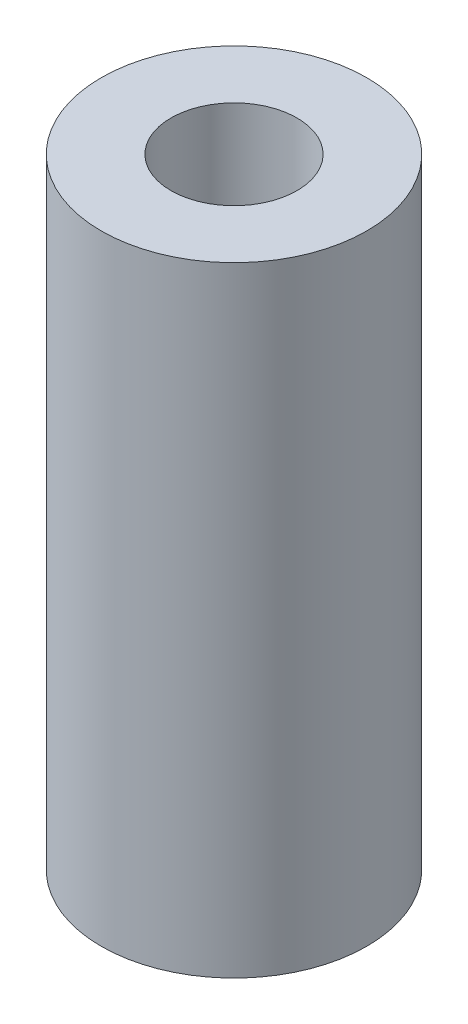
ISO-10303-21;
HEADER;
FILE_DESCRIPTION(('STEP AP214'),'2;1');
FILE_NAME('part.step','',(''),(''),'','','');
FILE_SCHEMA(('AUTOMOTIVE_DESIGN { 1 0 10303 214 1 1 1 1 }'));
ENDSEC;
DATA;
#1=APPLICATION_CONTEXT('core data for automotive mechanical design processes');
#2=APPLICATION_PROTOCOL_DEFINITION('international standard','automotive_design',2000,#1);
#3=PRODUCT_CONTEXT('',#1,'mechanical');
#4=PRODUCT('Part','Part','',(#3));
#5=PRODUCT_RELATED_PRODUCT_CATEGORY('part','',(#4));
#6=PRODUCT_DEFINITION_FORMATION('','',#4);
#7=PRODUCT_DEFINITION_CONTEXT('part definition',#1,'design');
#8=PRODUCT_DEFINITION('design','',#6,#7);
#9=PRODUCT_DEFINITION_SHAPE('','',#8);
#10=(LENGTH_UNIT() NAMED_UNIT(*) SI_UNIT(.MILLI.,.METRE.));
#11=(NAMED_UNIT(*) PLANE_ANGLE_UNIT() SI_UNIT($,.RADIAN.));
#12=(NAMED_UNIT(*) SI_UNIT($,.STERADIAN.) SOLID_ANGLE_UNIT());
#13=UNCERTAINTY_MEASURE_WITH_UNIT(LENGTH_MEASURE(1.E-05),#10,'distance_accuracy_value','');
#14=(GEOMETRIC_REPRESENTATION_CONTEXT(3) GLOBAL_UNCERTAINTY_ASSIGNED_CONTEXT((#13)) GLOBAL_UNIT_ASSIGNED_CONTEXT((#10,
#11,#12)) REPRESENTATION_CONTEXT('',''));
#15=CARTESIAN_POINT('',(0.,0.,0.));
#16=DIRECTION('',(0.,0.,1.));
#17=DIRECTION('',(1.,0.,0.));
#18=AXIS2_PLACEMENT_3D('',#15,#16,#17);
#19=CARTESIAN_POINT('',(0.,11.1125,0.));
#20=DIRECTION('',(0.,-1.,0.));
#21=DIRECTION('',(0.,0.,-1.));
#22=AXIS2_PLACEMENT_3D('',#19,#20,#21);
#23=CYLINDRICAL_SURFACE('',#22,2.38125);
#24=CARTESIAN_POINT('',(0.,11.1125,0.));
#25=DIRECTION('',(0.,1.,0.));
#26=DIRECTION('',(0.,0.,1.));
#27=AXIS2_PLACEMENT_3D('',#24,#25,#26);
#28=CIRCLE('',#27,2.38125);
#29=CARTESIAN_POINT('',(0.,11.1125,2.38125));
#30=VERTEX_POINT('',#29);
#31=EDGE_CURVE('E10',#30,#30,#28,.T.);
#32=ORIENTED_EDGE('',*,*,#31,.F.);
#33=EDGE_LOOP('',(#32));
#34=FACE_BOUND('',#33,.T.);
#35=CARTESIAN_POINT('',(0.,0.,0.));
#36=DIRECTION('',(0.,1.,0.));
#37=DIRECTION('',(0.,0.,1.));
#38=AXIS2_PLACEMENT_3D('',#35,#36,#37);
#39=CIRCLE('',#38,2.38125);
#40=CARTESIAN_POINT('',(0.,0.,2.38125));
#41=VERTEX_POINT('',#40);
#42=EDGE_CURVE('E33',#41,#41,#39,.T.);
#43=ORIENTED_EDGE('',*,*,#42,.T.);
#44=EDGE_LOOP('',(#43));
#45=FACE_BOUND('',#44,.T.);
#46=ADVANCED_FACE('F30',(#34,#45),#23,.T.);
#47=CARTESIAN_POINT('',(0.,11.1125,0.));
#48=DIRECTION('',(0.,1.,0.));
#49=DIRECTION('',(0.,0.,1.));
#50=AXIS2_PLACEMENT_3D('',#47,#48,#49);
#51=PLANE('',#50);
#52=CARTESIAN_POINT('',(0.,11.1125,0.));
#53=DIRECTION('',(0.,1.,0.));
#54=DIRECTION('',(0.,0.,1.));
#55=AXIS2_PLACEMENT_3D('',#52,#53,#54);
#56=CIRCLE('',#55,1.13029999999999);
#57=CARTESIAN_POINT('',(0.,11.1125,1.13029999999999));
#58=VERTEX_POINT('',#57);
#59=EDGE_CURVE('E44',#58,#58,#56,.T.);
#60=ORIENTED_EDGE('',*,*,#59,.F.);
#61=EDGE_LOOP('',(#60));
#62=FACE_BOUND('',#61,.T.);
#63=ORIENTED_EDGE('',*,*,#31,.T.);
#64=EDGE_LOOP('',(#63));
#65=FACE_BOUND('',#64,.T.);
#66=ADVANCED_FACE('F50',(#62,#65),#51,.T.);
#67=CARTESIAN_POINT('',(0.,0.,0.));
#68=DIRECTION('',(0.,1.,0.));
#69=DIRECTION('',(0.,0.,1.));
#70=AXIS2_PLACEMENT_3D('',#67,#68,#69);
#71=PLANE('',#70);
#72=CARTESIAN_POINT('',(0.,0.,0.));
#73=DIRECTION('',(0.,1.,0.));
#74=DIRECTION('',(0.,0.,1.));
#75=AXIS2_PLACEMENT_3D('',#72,#73,#74);
#76=CIRCLE('',#75,1.13029999999999);
#77=CARTESIAN_POINT('',(0.,0.,1.13029999999999));
#78=VERTEX_POINT('',#77);
#79=EDGE_CURVE('E40',#78,#78,#76,.T.);
#80=ORIENTED_EDGE('',*,*,#79,.T.);
#81=EDGE_LOOP('',(#80));
#82=FACE_BOUND('',#81,.T.);
#83=ORIENTED_EDGE('',*,*,#42,.F.);
#84=EDGE_LOOP('',(#83));
#85=FACE_BOUND('',#84,.T.);
#86=ADVANCED_FACE('F52',(#82,#85),#71,.F.);
#87=CARTESIAN_POINT('',(0.,11.1125,0.));
#88=DIRECTION('',(0.,1.,0.));
#89=DIRECTION('',(0.,0.,1.));
#90=AXIS2_PLACEMENT_3D('',#87,#88,#89);
#91=CYLINDRICAL_SURFACE('',#90,1.13029999999999);
#92=ORIENTED_EDGE('',*,*,#79,.F.);
#93=EDGE_LOOP('',(#92));
#94=FACE_BOUND('',#93,.T.);
#95=ORIENTED_EDGE('',*,*,#59,.T.);
#96=EDGE_LOOP('',(#95));
#97=FACE_BOUND('',#96,.T.);
#98=ADVANCED_FACE('F48',(#94,#97),#91,.F.);
#99=CLOSED_SHELL('',(#46,#66,#86,#98));
#100=MANIFOLD_SOLID_BREP('B2',#99);
#101=ADVANCED_BREP_SHAPE_REPRESENTATION('',(#18,#100),#14);
#102=SHAPE_DEFINITION_REPRESENTATION(#9,#101);
ENDSEC;
END-ISO-10303-21;
